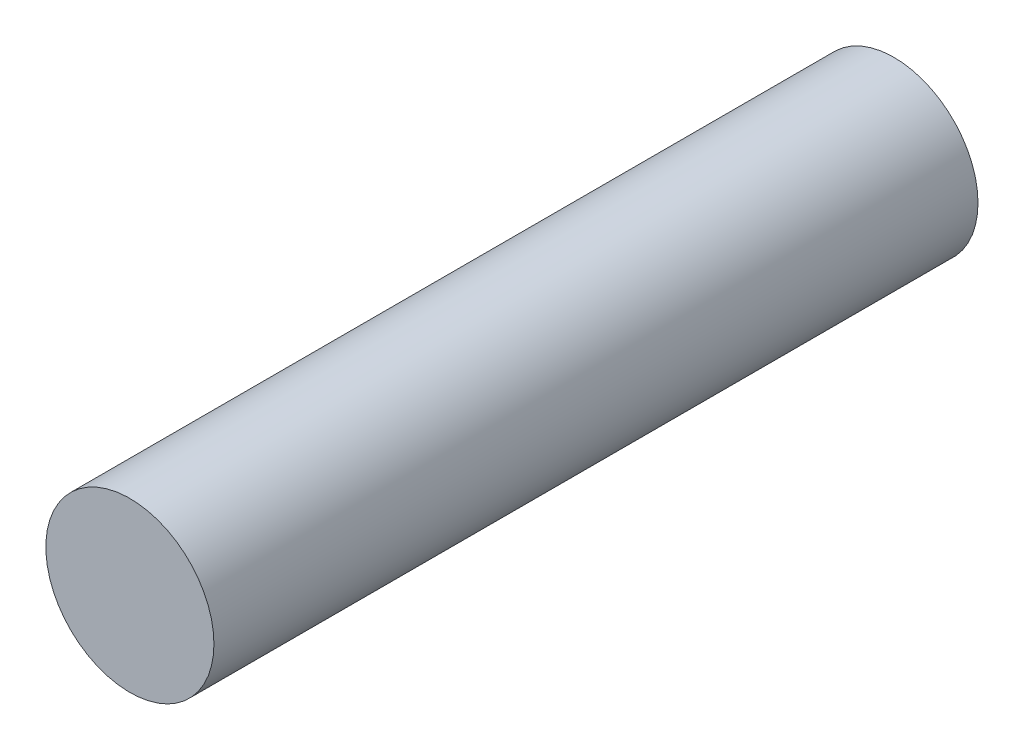
ISO-10303-21;
HEADER;
FILE_DESCRIPTION(('STEP AP214'),'2;1');
FILE_NAME('part.step','',(''),(''),'','','');
FILE_SCHEMA(('AUTOMOTIVE_DESIGN { 1 0 10303 214 1 1 1 1 }'));
ENDSEC;
DATA;
#1=APPLICATION_CONTEXT('core data for automotive mechanical design processes');
#2=APPLICATION_PROTOCOL_DEFINITION('international standard','automotive_design',2000,#1);
#3=PRODUCT_CONTEXT('',#1,'mechanical');
#4=PRODUCT('Part','Part','',(#3));
#5=PRODUCT_RELATED_PRODUCT_CATEGORY('part','',(#4));
#6=PRODUCT_DEFINITION_FORMATION('','',#4);
#7=PRODUCT_DEFINITION_CONTEXT('part definition',#1,'design');
#8=PRODUCT_DEFINITION('design','',#6,#7);
#9=PRODUCT_DEFINITION_SHAPE('','',#8);
#10=(LENGTH_UNIT() NAMED_UNIT(*) SI_UNIT(.MILLI.,.METRE.));
#11=(NAMED_UNIT(*) PLANE_ANGLE_UNIT() SI_UNIT($,.RADIAN.));
#12=(NAMED_UNIT(*) SI_UNIT($,.STERADIAN.) SOLID_ANGLE_UNIT());
#13=UNCERTAINTY_MEASURE_WITH_UNIT(LENGTH_MEASURE(1.E-05),#10,'distance_accuracy_value','');
#14=(GEOMETRIC_REPRESENTATION_CONTEXT(3) GLOBAL_UNCERTAINTY_ASSIGNED_CONTEXT((#13)) GLOBAL_UNIT_ASSIGNED_CONTEXT((#10,
#11,#12)) REPRESENTATION_CONTEXT('',''));
#15=CARTESIAN_POINT('',(0.,0.,0.));
#16=DIRECTION('',(0.,0.,1.));
#17=DIRECTION('',(1.,0.,0.));
#18=AXIS2_PLACEMENT_3D('',#15,#16,#17);
#19=CARTESIAN_POINT('',(0.,0.,50.));
#20=DIRECTION('',(0.,0.,-1.));
#21=DIRECTION('',(-1.,0.,0.));
#22=AXIS2_PLACEMENT_3D('',#19,#20,#21);
#23=CYLINDRICAL_SURFACE('',#22,5.5);
#24=CARTESIAN_POINT('',(0.,0.,50.));
#25=DIRECTION('',(0.,0.,1.));
#26=DIRECTION('',(1.,0.,0.));
#27=AXIS2_PLACEMENT_3D('',#24,#25,#26);
#28=CIRCLE('',#27,5.5);
#29=CARTESIAN_POINT('',(5.5,0.,50.));
#30=VERTEX_POINT('',#29);
#31=EDGE_CURVE('E10',#30,#30,#28,.T.);
#32=ORIENTED_EDGE('',*,*,#31,.F.);
#33=EDGE_LOOP('',(#32));
#34=FACE_BOUND('',#33,.T.);
#35=CARTESIAN_POINT('',(0.,0.,0.));
#36=DIRECTION('',(0.,0.,1.));
#37=DIRECTION('',(1.,0.,0.));
#38=AXIS2_PLACEMENT_3D('',#35,#36,#37);
#39=CIRCLE('',#38,5.5);
#40=CARTESIAN_POINT('',(5.5,0.,0.));
#41=VERTEX_POINT('',#40);
#42=EDGE_CURVE('E34',#41,#41,#39,.T.);
#43=ORIENTED_EDGE('',*,*,#42,.T.);
#44=EDGE_LOOP('',(#43));
#45=FACE_BOUND('',#44,.T.);
#46=ADVANCED_FACE('F31',(#34,#45),#23,.T.);
#47=CARTESIAN_POINT('',(0.,0.,50.));
#48=DIRECTION('',(0.,0.,1.));
#49=DIRECTION('',(1.,0.,0.));
#50=AXIS2_PLACEMENT_3D('',#47,#48,#49);
#51=PLANE('',#50);
#52=ORIENTED_EDGE('',*,*,#31,.T.);
#53=EDGE_LOOP('',(#52));
#54=FACE_BOUND('',#53,.T.);
#55=ADVANCED_FACE('F46',(#54),#51,.T.);
#56=CARTESIAN_POINT('',(0.,0.,0.));
#57=DIRECTION('',(0.,0.,1.));
#58=DIRECTION('',(1.,0.,0.));
#59=AXIS2_PLACEMENT_3D('',#56,#57,#58);
#60=PLANE('',#59);
#61=ORIENTED_EDGE('',*,*,#42,.F.);
#62=EDGE_LOOP('',(#61));
#63=FACE_BOUND('',#62,.T.);
#64=ADVANCED_FACE('F44',(#63),#60,.F.);
#65=CLOSED_SHELL('',(#46,#55,#64));
#66=MANIFOLD_SOLID_BREP('B2',#65);
#67=ADVANCED_BREP_SHAPE_REPRESENTATION('',(#18,#66),#14);
#68=SHAPE_DEFINITION_REPRESENTATION(#9,#67);
ENDSEC;
END-ISO-10303-21;
